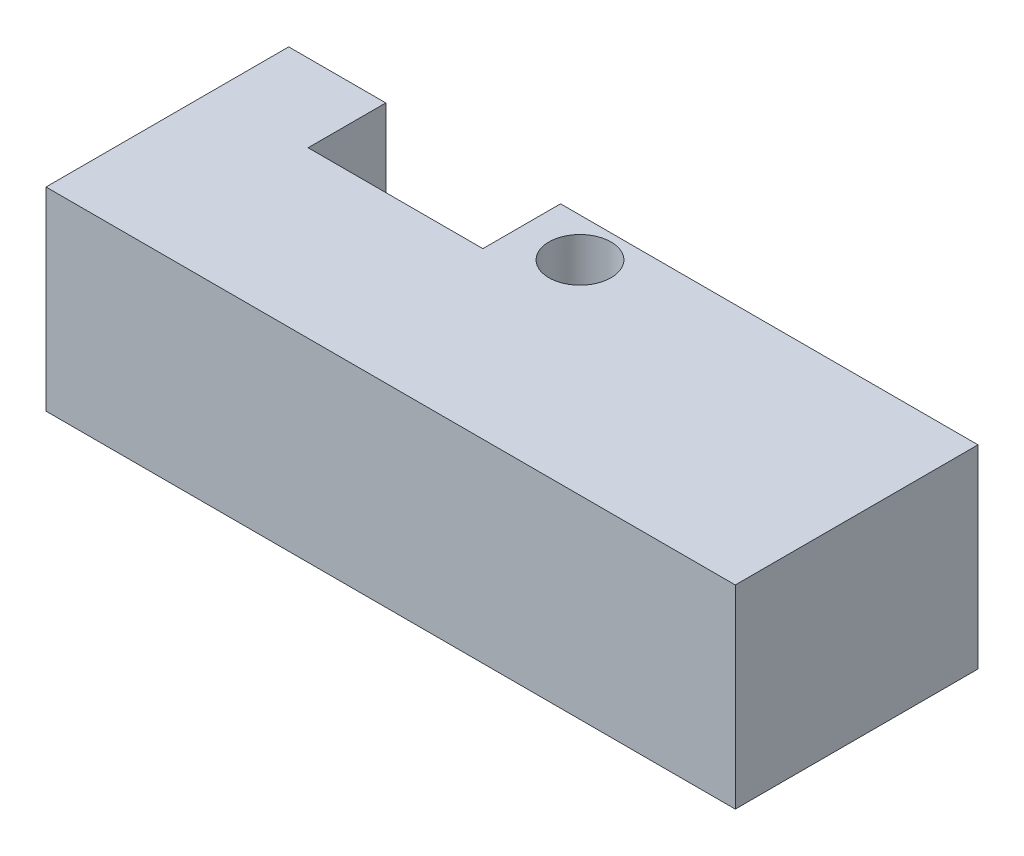
ISO-10303-21;
HEADER;
FILE_DESCRIPTION(('STEP AP214'),'2;1');
FILE_NAME('part.step','',(''),(''),'','','');
FILE_SCHEMA(('AUTOMOTIVE_DESIGN { 1 0 10303 214 1 1 1 1 }'));
ENDSEC;
DATA;
#1=APPLICATION_CONTEXT('core data for automotive mechanical design processes');
#2=APPLICATION_PROTOCOL_DEFINITION('international standard','automotive_design',2000,#1);
#3=PRODUCT_CONTEXT('',#1,'mechanical');
#4=PRODUCT('Part','Part','',(#3));
#5=PRODUCT_RELATED_PRODUCT_CATEGORY('part','',(#4));
#6=PRODUCT_DEFINITION_FORMATION('','',#4);
#7=PRODUCT_DEFINITION_CONTEXT('part definition',#1,'design');
#8=PRODUCT_DEFINITION('design','',#6,#7);
#9=PRODUCT_DEFINITION_SHAPE('','',#8);
#10=(LENGTH_UNIT() NAMED_UNIT(*) SI_UNIT(.MILLI.,.METRE.));
#11=(NAMED_UNIT(*) PLANE_ANGLE_UNIT() SI_UNIT($,.RADIAN.));
#12=(NAMED_UNIT(*) SI_UNIT($,.STERADIAN.) SOLID_ANGLE_UNIT());
#13=UNCERTAINTY_MEASURE_WITH_UNIT(LENGTH_MEASURE(1.E-05),#10,'distance_accuracy_value','');
#14=(GEOMETRIC_REPRESENTATION_CONTEXT(3) GLOBAL_UNCERTAINTY_ASSIGNED_CONTEXT((#13)) GLOBAL_UNIT_ASSIGNED_CONTEXT((#10,
#11,#12)) REPRESENTATION_CONTEXT('',''));
#15=CARTESIAN_POINT('',(0.,0.,0.));
#16=DIRECTION('',(0.,0.,1.));
#17=DIRECTION('',(1.,0.,0.));
#18=AXIS2_PLACEMENT_3D('',#15,#16,#17);
#19=CARTESIAN_POINT('',(-17.75,10.,-6.25));
#20=DIRECTION('',(0.,0.,1.));
#21=DIRECTION('',(1.,0.,0.));
#22=AXIS2_PLACEMENT_3D('',#19,#20,#21);
#23=PLANE('',#22);
#24=CARTESIAN_POINT('',(-14.75,3.,-6.25));
#25=DIRECTION('',(0.,0.,-1.));
#26=DIRECTION('',(1.,0.,0.));
#27=AXIS2_PLACEMENT_3D('',#24,#25,#26);
#28=CIRCLE('',#27,1.);
#29=CARTESIAN_POINT('',(-13.75,3.,-6.25));
#30=VERTEX_POINT('',#29);
#31=EDGE_CURVE('E148',#30,#30,#28,.T.);
#32=ORIENTED_EDGE('',*,*,#31,.F.);
#33=EDGE_LOOP('',(#32));
#34=FACE_BOUND('',#33,.T.);
#35=DIRECTION('',(-1.,0.,0.));
#36=VECTOR('',#35,1.);
#37=CARTESIAN_POINT('',(-17.75,10.,-6.25));
#38=LINE('',#37,#36);
#39=CARTESIAN_POINT('',(-12.75,10.,-6.25));
#40=VERTEX_POINT('',#39);
#41=CARTESIAN_POINT('',(-17.75,10.,-6.25));
#42=VERTEX_POINT('',#41);
#43=EDGE_CURVE('E188',#40,#42,#38,.T.);
#44=ORIENTED_EDGE('',*,*,#43,.F.);
#45=DIRECTION('',(0.,-1.,0.));
#46=VECTOR('',#45,1.);
#47=CARTESIAN_POINT('',(-12.75,7.5,-6.25));
#48=LINE('',#47,#46);
#49=CARTESIAN_POINT('',(-12.75,0.,-6.25));
#50=VERTEX_POINT('',#49);
#51=EDGE_CURVE('E122',#40,#50,#48,.T.);
#52=ORIENTED_EDGE('',*,*,#51,.T.);
#53=DIRECTION('',(-1.,0.,0.));
#54=VECTOR('',#53,1.);
#55=CARTESIAN_POINT('',(-17.75,0.,-6.25));
#56=LINE('',#55,#54);
#57=CARTESIAN_POINT('',(-17.75,0.,-6.25));
#58=VERTEX_POINT('',#57);
#59=EDGE_CURVE('E199',#50,#58,#56,.T.);
#60=ORIENTED_EDGE('',*,*,#59,.T.);
#61=DIRECTION('',(0.,-1.,0.));
#62=VECTOR('',#61,1.);
#63=CARTESIAN_POINT('',(-17.75,10.,-6.25));
#64=LINE('',#63,#62);
#65=EDGE_CURVE('E41',#42,#58,#64,.T.);
#66=ORIENTED_EDGE('',*,*,#65,.F.);
#67=EDGE_LOOP('',(#44,#52,#60,#66));
#68=FACE_BOUND('',#67,.T.);
#69=ADVANCED_FACE('F33',(#34,#68),#23,.F.);
#70=CARTESIAN_POINT('',(17.75,10.,6.25));
#71=DIRECTION('',(-1.,0.,0.));
#72=DIRECTION('',(0.,0.,1.));
#73=AXIS2_PLACEMENT_3D('',#70,#71,#72);
#74=PLANE('',#73);
#75=DIRECTION('',(0.,0.,-1.));
#76=VECTOR('',#75,1.);
#77=CARTESIAN_POINT('',(17.75,0.,6.25));
#78=LINE('',#77,#76);
#79=CARTESIAN_POINT('',(17.75,0.,6.25));
#80=VERTEX_POINT('',#79);
#81=CARTESIAN_POINT('',(17.75,0.,-6.25));
#82=VERTEX_POINT('',#81);
#83=EDGE_CURVE('E180',#80,#82,#78,.T.);
#84=ORIENTED_EDGE('',*,*,#83,.T.);
#85=DIRECTION('',(0.,-1.,0.));
#86=VECTOR('',#85,1.);
#87=CARTESIAN_POINT('',(17.75,10.,-6.25));
#88=LINE('',#87,#86);
#89=CARTESIAN_POINT('',(17.75,10.,-6.25));
#90=VERTEX_POINT('',#89);
#91=EDGE_CURVE('E11',#90,#82,#88,.T.);
#92=ORIENTED_EDGE('',*,*,#91,.F.);
#93=DIRECTION('',(0.,0.,-1.));
#94=VECTOR('',#93,1.);
#95=CARTESIAN_POINT('',(17.75,10.,6.25));
#96=LINE('',#95,#94);
#97=CARTESIAN_POINT('',(17.75,10.,6.25));
#98=VERTEX_POINT('',#97);
#99=EDGE_CURVE('E185',#98,#90,#96,.T.);
#100=ORIENTED_EDGE('',*,*,#99,.F.);
#101=DIRECTION('',(0.,-1.,0.));
#102=VECTOR('',#101,1.);
#103=CARTESIAN_POINT('',(17.75,10.,6.25));
#104=LINE('',#103,#102);
#105=EDGE_CURVE('E196',#98,#80,#104,.T.);
#106=ORIENTED_EDGE('',*,*,#105,.T.);
#107=EDGE_LOOP('',(#84,#92,#100,#106));
#108=FACE_BOUND('',#107,.T.);
#109=ADVANCED_FACE('F35',(#108),#74,.F.);
#110=CARTESIAN_POINT('',(14.75,3.,-6.25));
#111=DIRECTION('',(0.,0.,-1.));
#112=DIRECTION('',(-1.,0.,0.));
#113=AXIS2_PLACEMENT_3D('',#110,#111,#112);
#114=CIRCLE('',#113,1.);
#115=CARTESIAN_POINT('',(13.75,3.,-6.25));
#116=VERTEX_POINT('',#115);
#117=EDGE_CURVE('E153',#116,#116,#114,.T.);
#118=ORIENTED_EDGE('',*,*,#117,.F.);
#119=EDGE_LOOP('',(#118));
#120=FACE_BOUND('',#119,.T.);
#121=DIRECTION('',(1.,0.,0.));
#122=VECTOR('',#121,1.);
#123=CARTESIAN_POINT('',(-12.75,7.5,-6.25));
#124=LINE('',#123,#122);
#125=CARTESIAN_POINT('',(-3.74999999999999,7.5,-6.25));
#126=VERTEX_POINT('',#125);
#127=CARTESIAN_POINT('',(12.75,7.5,-6.25000000000001));
#128=VERTEX_POINT('',#127);
#129=EDGE_CURVE('E167',#126,#128,#124,.T.);
#130=ORIENTED_EDGE('',*,*,#129,.F.);
#131=DIRECTION('',(0.,-1.,0.));
#132=VECTOR('',#131,1.);
#133=CARTESIAN_POINT('',(-3.74999999999999,7.5,-6.25));
#134=LINE('',#133,#132);
#135=CARTESIAN_POINT('',(-3.74999999999999,10.,-6.25));
#136=VERTEX_POINT('',#135);
#137=EDGE_CURVE('E134',#136,#126,#134,.T.);
#138=ORIENTED_EDGE('',*,*,#137,.F.);
#139=EDGE_CURVE('E190',#90,#136,#38,.T.);
#140=ORIENTED_EDGE('',*,*,#139,.F.);
#141=ORIENTED_EDGE('',*,*,#91,.T.);
#142=CARTESIAN_POINT('',(12.75,0.,-6.25000000000001));
#143=VERTEX_POINT('',#142);
#144=EDGE_CURVE('E200',#82,#143,#56,.T.);
#145=ORIENTED_EDGE('',*,*,#144,.T.);
#146=DIRECTION('',(0.,-1.,0.));
#147=VECTOR('',#146,1.);
#148=CARTESIAN_POINT('',(12.75,7.5,-6.25000000000001));
#149=LINE('',#148,#147);
#150=EDGE_CURVE('E181',#128,#143,#149,.T.);
#151=ORIENTED_EDGE('',*,*,#150,.F.);
#152=EDGE_LOOP('',(#130,#138,#140,#141,#145,#151));
#153=FACE_BOUND('',#152,.T.);
#154=ADVANCED_FACE('F234',(#120,#153),#23,.F.);
#155=CARTESIAN_POINT('',(-17.75,10.,6.25));
#156=DIRECTION('',(1.,0.,0.));
#157=DIRECTION('',(0.,0.,-1.));
#158=AXIS2_PLACEMENT_3D('',#155,#156,#157);
#159=PLANE('',#158);
#160=DIRECTION('',(0.,0.,1.));
#161=VECTOR('',#160,1.);
#162=CARTESIAN_POINT('',(-17.75,0.,6.25));
#163=LINE('',#162,#161);
#164=CARTESIAN_POINT('',(-17.75,0.,6.25));
#165=VERTEX_POINT('',#164);
#166=EDGE_CURVE('E203',#58,#165,#163,.T.);
#167=ORIENTED_EDGE('',*,*,#166,.T.);
#168=DIRECTION('',(0.,-1.,0.));
#169=VECTOR('',#168,1.);
#170=CARTESIAN_POINT('',(-17.75,10.,6.25));
#171=LINE('',#170,#169);
#172=CARTESIAN_POINT('',(-17.75,10.,6.25));
#173=VERTEX_POINT('',#172);
#174=EDGE_CURVE('E208',#173,#165,#171,.T.);
#175=ORIENTED_EDGE('',*,*,#174,.F.);
#176=DIRECTION('',(0.,0.,1.));
#177=VECTOR('',#176,1.);
#178=CARTESIAN_POINT('',(-17.75,10.,6.25));
#179=LINE('',#178,#177);
#180=EDGE_CURVE('E192',#42,#173,#179,.T.);
#181=ORIENTED_EDGE('',*,*,#180,.F.);
#182=ORIENTED_EDGE('',*,*,#65,.T.);
#183=EDGE_LOOP('',(#167,#175,#181,#182));
#184=FACE_BOUND('',#183,.T.);
#185=ADVANCED_FACE('F215',(#184),#159,.F.);
#186=CARTESIAN_POINT('',(-17.75,10.,6.25));
#187=DIRECTION('',(0.,0.,-1.));
#188=DIRECTION('',(-1.,0.,0.));
#189=AXIS2_PLACEMENT_3D('',#186,#187,#188);
#190=PLANE('',#189);
#191=DIRECTION('',(1.,0.,0.));
#192=VECTOR('',#191,1.);
#193=CARTESIAN_POINT('',(-17.75,0.,6.25));
#194=LINE('',#193,#192);
#195=EDGE_CURVE('E189',#165,#80,#194,.T.);
#196=ORIENTED_EDGE('',*,*,#195,.T.);
#197=ORIENTED_EDGE('',*,*,#105,.F.);
#198=DIRECTION('',(1.,0.,0.));
#199=VECTOR('',#198,1.);
#200=CARTESIAN_POINT('',(-17.75,10.,6.25));
#201=LINE('',#200,#199);
#202=EDGE_CURVE('E194',#173,#98,#201,.T.);
#203=ORIENTED_EDGE('',*,*,#202,.F.);
#204=ORIENTED_EDGE('',*,*,#174,.T.);
#205=EDGE_LOOP('',(#196,#197,#203,#204));
#206=FACE_BOUND('',#205,.T.);
#207=ADVANCED_FACE('F227',(#206),#190,.F.);
#208=CARTESIAN_POINT('',(0.,10.,0.));
#209=DIRECTION('',(0.,-1.,0.));
#210=DIRECTION('',(0.,0.,-1.));
#211=AXIS2_PLACEMENT_3D('',#208,#209,#210);
#212=PLANE('',#211);
#213=CARTESIAN_POINT('',(-0.749999999999989,10.,-4.25));
#214=DIRECTION('',(0.,-1.,0.));
#215=DIRECTION('',(0.,0.,-1.));
#216=AXIS2_PLACEMENT_3D('',#213,#214,#215);
#217=CIRCLE('',#216,1.6);
#218=CARTESIAN_POINT('',(-0.749999999999989,10.,-5.85));
#219=VERTEX_POINT('',#218);
#220=EDGE_CURVE('E144',#219,#219,#217,.F.);
#221=ORIENTED_EDGE('',*,*,#220,.F.);
#222=EDGE_LOOP('',(#221));
#223=FACE_BOUND('',#222,.T.);
#224=DIRECTION('',(1.,0.,0.));
#225=VECTOR('',#224,1.);
#226=CARTESIAN_POINT('',(-12.75,10.,-2.25));
#227=LINE('',#226,#225);
#228=CARTESIAN_POINT('',(-12.75,10.,-2.25));
#229=VERTEX_POINT('',#228);
#230=CARTESIAN_POINT('',(-3.74999999999999,10.,-2.25));
#231=VERTEX_POINT('',#230);
#232=EDGE_CURVE('E130',#229,#231,#227,.T.);
#233=ORIENTED_EDGE('',*,*,#232,.F.);
#234=DIRECTION('',(0.,0.,-1.));
#235=VECTOR('',#234,1.);
#236=CARTESIAN_POINT('',(-12.75,10.,-2.25));
#237=LINE('',#236,#235);
#238=EDGE_CURVE('E116',#229,#40,#237,.T.);
#239=ORIENTED_EDGE('',*,*,#238,.T.);
#240=ORIENTED_EDGE('',*,*,#43,.T.);
#241=ORIENTED_EDGE('',*,*,#180,.T.);
#242=ORIENTED_EDGE('',*,*,#202,.T.);
#243=ORIENTED_EDGE('',*,*,#99,.T.);
#244=ORIENTED_EDGE('',*,*,#139,.T.);
#245=DIRECTION('',(0.,0.,-1.));
#246=VECTOR('',#245,1.);
#247=CARTESIAN_POINT('',(-3.74999999999999,10.,-2.25));
#248=LINE('',#247,#246);
#249=EDGE_CURVE('E126',#231,#136,#248,.T.);
#250=ORIENTED_EDGE('',*,*,#249,.F.);
#251=EDGE_LOOP('',(#233,#239,#240,#241,#242,#243,#244,#250));
#252=FACE_BOUND('',#251,.T.);
#253=ADVANCED_FACE('F136',(#223,#252),#212,.F.);
#254=CARTESIAN_POINT('',(0.,0.,0.));
#255=DIRECTION('',(0.,-1.,0.));
#256=DIRECTION('',(0.,0.,-1.));
#257=AXIS2_PLACEMENT_3D('',#254,#255,#256);
#258=PLANE('',#257);
#259=DIRECTION('',(0.,0.,1.));
#260=VECTOR('',#259,1.);
#261=CARTESIAN_POINT('',(12.75,0.,1.25000000000001));
#262=LINE('',#261,#260);
#263=CARTESIAN_POINT('',(12.75,0.,1.25000000000001));
#264=VERTEX_POINT('',#263);
#265=EDGE_CURVE('E165',#143,#264,#262,.T.);
#266=ORIENTED_EDGE('',*,*,#265,.F.);
#267=ORIENTED_EDGE('',*,*,#144,.F.);
#268=ORIENTED_EDGE('',*,*,#83,.F.);
#269=ORIENTED_EDGE('',*,*,#195,.F.);
#270=ORIENTED_EDGE('',*,*,#166,.F.);
#271=ORIENTED_EDGE('',*,*,#59,.F.);
#272=DIRECTION('',(0.,0.,-1.));
#273=VECTOR('',#272,1.);
#274=CARTESIAN_POINT('',(-12.75,0.,1.25));
#275=LINE('',#274,#273);
#276=CARTESIAN_POINT('',(-12.75,0.,1.25));
#277=VERTEX_POINT('',#276);
#278=EDGE_CURVE('E174',#277,#50,#275,.T.);
#279=ORIENTED_EDGE('',*,*,#278,.F.);
#280=DIRECTION('',(-1.,0.,0.));
#281=VECTOR('',#280,1.);
#282=CARTESIAN_POINT('',(-12.75,0.,1.25));
#283=LINE('',#282,#281);
#284=EDGE_CURVE('E56',#264,#277,#283,.T.);
#285=ORIENTED_EDGE('',*,*,#284,.F.);
#286=EDGE_LOOP('',(#266,#267,#268,#269,#270,#271,#279,#285));
#287=FACE_BOUND('',#286,.T.);
#288=ADVANCED_FACE('F222',(#287),#258,.T.);
#289=CARTESIAN_POINT('',(-12.75,7.5,1.25));
#290=DIRECTION('',(0.,0.,1.));
#291=DIRECTION('',(1.,0.,0.));
#292=AXIS2_PLACEMENT_3D('',#289,#290,#291);
#293=PLANE('',#292);
#294=ORIENTED_EDGE('',*,*,#284,.T.);
#295=DIRECTION('',(0.,-1.,0.));
#296=VECTOR('',#295,1.);
#297=CARTESIAN_POINT('',(-12.75,7.5,1.25));
#298=LINE('',#297,#296);
#299=CARTESIAN_POINT('',(-12.75,7.5,1.25));
#300=VERTEX_POINT('',#299);
#301=EDGE_CURVE('E172',#300,#277,#298,.T.);
#302=ORIENTED_EDGE('',*,*,#301,.F.);
#303=DIRECTION('',(-1.,0.,0.));
#304=VECTOR('',#303,1.);
#305=CARTESIAN_POINT('',(-12.75,7.5,1.25));
#306=LINE('',#305,#304);
#307=CARTESIAN_POINT('',(12.75,7.5,1.25000000000001));
#308=VERTEX_POINT('',#307);
#309=EDGE_CURVE('E161',#308,#300,#306,.T.);
#310=ORIENTED_EDGE('',*,*,#309,.F.);
#311=DIRECTION('',(0.,-1.,0.));
#312=VECTOR('',#311,1.);
#313=CARTESIAN_POINT('',(12.75,7.5,1.25000000000001));
#314=LINE('',#313,#312);
#315=EDGE_CURVE('E178',#308,#264,#314,.T.);
#316=ORIENTED_EDGE('',*,*,#315,.T.);
#317=EDGE_LOOP('',(#294,#302,#310,#316));
#318=FACE_BOUND('',#317,.T.);
#319=ADVANCED_FACE('F258',(#318),#293,.F.);
#320=CARTESIAN_POINT('',(12.75,7.5,1.25000000000001));
#321=DIRECTION('',(1.,0.,0.));
#322=DIRECTION('',(0.,0.,-1.));
#323=AXIS2_PLACEMENT_3D('',#320,#321,#322);
#324=PLANE('',#323);
#325=ORIENTED_EDGE('',*,*,#265,.T.);
#326=ORIENTED_EDGE('',*,*,#315,.F.);
#327=DIRECTION('',(0.,0.,1.));
#328=VECTOR('',#327,1.);
#329=CARTESIAN_POINT('',(12.75,7.5,1.25000000000001));
#330=LINE('',#329,#328);
#331=EDGE_CURVE('E169',#128,#308,#330,.T.);
#332=ORIENTED_EDGE('',*,*,#331,.F.);
#333=ORIENTED_EDGE('',*,*,#150,.T.);
#334=EDGE_LOOP('',(#325,#326,#332,#333));
#335=FACE_BOUND('',#334,.T.);
#336=ADVANCED_FACE('F256',(#335),#324,.F.);
#337=CARTESIAN_POINT('',(-12.75,7.5,1.25));
#338=DIRECTION('',(-1.,0.,0.));
#339=DIRECTION('',(0.,0.,1.));
#340=AXIS2_PLACEMENT_3D('',#337,#338,#339);
#341=PLANE('',#340);
#342=ORIENTED_EDGE('',*,*,#278,.T.);
#343=ORIENTED_EDGE('',*,*,#51,.F.);
#344=ORIENTED_EDGE('',*,*,#238,.F.);
#345=DIRECTION('',(0.,1.,0.));
#346=VECTOR('',#345,1.);
#347=CARTESIAN_POINT('',(-12.75,7.5,-2.25));
#348=LINE('',#347,#346);
#349=CARTESIAN_POINT('',(-12.75,7.5,-2.25));
#350=VERTEX_POINT('',#349);
#351=EDGE_CURVE('E120',#350,#229,#348,.T.);
#352=ORIENTED_EDGE('',*,*,#351,.F.);
#353=DIRECTION('',(0.,0.,-1.));
#354=VECTOR('',#353,1.);
#355=CARTESIAN_POINT('',(-12.75,7.5,1.25));
#356=LINE('',#355,#354);
#357=EDGE_CURVE('E164',#300,#350,#356,.T.);
#358=ORIENTED_EDGE('',*,*,#357,.F.);
#359=ORIENTED_EDGE('',*,*,#301,.T.);
#360=EDGE_LOOP('',(#342,#343,#344,#352,#358,#359));
#361=FACE_BOUND('',#360,.T.);
#362=ADVANCED_FACE('F118',(#361),#341,.F.);
#363=CARTESIAN_POINT('',(0.,7.5,0.));
#364=DIRECTION('',(0.,1.,0.));
#365=DIRECTION('',(0.,0.,1.));
#366=AXIS2_PLACEMENT_3D('',#363,#364,#365);
#367=PLANE('',#366);
#368=CARTESIAN_POINT('',(-0.749999999999989,7.5,-4.25));
#369=DIRECTION('',(0.,1.,0.));
#370=DIRECTION('',(0.,0.,1.));
#371=AXIS2_PLACEMENT_3D('',#368,#369,#370);
#372=CIRCLE('',#371,1.6);
#373=CARTESIAN_POINT('',(-0.749999999999989,7.5,-2.65));
#374=VERTEX_POINT('',#373);
#375=EDGE_CURVE('E392',#374,#374,#372,.F.);
#376=ORIENTED_EDGE('',*,*,#375,.F.);
#377=EDGE_LOOP('',(#376));
#378=FACE_BOUND('',#377,.T.);
#379=DIRECTION('',(-1.,0.,0.));
#380=VECTOR('',#379,1.);
#381=CARTESIAN_POINT('',(-12.75,7.5,-2.25));
#382=LINE('',#381,#380);
#383=CARTESIAN_POINT('',(-3.74999999999999,7.5,-2.25));
#384=VERTEX_POINT('',#383);
#385=EDGE_CURVE('E127',#384,#350,#382,.T.);
#386=ORIENTED_EDGE('',*,*,#385,.F.);
#387=DIRECTION('',(0.,0.,-1.));
#388=VECTOR('',#387,1.);
#389=CARTESIAN_POINT('',(-3.74999999999999,7.5,-2.25));
#390=LINE('',#389,#388);
#391=EDGE_CURVE('E145',#384,#126,#390,.T.);
#392=ORIENTED_EDGE('',*,*,#391,.T.);
#393=ORIENTED_EDGE('',*,*,#129,.T.);
#394=ORIENTED_EDGE('',*,*,#331,.T.);
#395=ORIENTED_EDGE('',*,*,#309,.T.);
#396=ORIENTED_EDGE('',*,*,#357,.T.);
#397=EDGE_LOOP('',(#386,#392,#393,#394,#395,#396));
#398=FACE_BOUND('',#397,.T.);
#399=ADVANCED_FACE('F254',(#378,#398),#367,.F.);
#400=CARTESIAN_POINT('',(-14.75,3.,-2.25));
#401=DIRECTION('',(0.,0.,-1.));
#402=DIRECTION('',(-1.,0.,0.));
#403=AXIS2_PLACEMENT_3D('',#400,#401,#402);
#404=CYLINDRICAL_SURFACE('',#403,1.);
#405=CARTESIAN_POINT('',(-14.75,3.,-2.25));
#406=DIRECTION('',(0.,0.,-1.));
#407=DIRECTION('',(1.,0.,0.));
#408=AXIS2_PLACEMENT_3D('',#405,#406,#407);
#409=CIRCLE('',#408,1.);
#410=CARTESIAN_POINT('',(-13.75,3.,-2.25));
#411=VERTEX_POINT('',#410);
#412=EDGE_CURVE('E156',#411,#411,#409,.T.);
#413=ORIENTED_EDGE('',*,*,#412,.F.);
#414=EDGE_LOOP('',(#413));
#415=FACE_BOUND('',#414,.T.);
#416=ORIENTED_EDGE('',*,*,#31,.T.);
#417=EDGE_LOOP('',(#416));
#418=FACE_BOUND('',#417,.T.);
#419=ADVANCED_FACE('F306',(#415,#418),#404,.F.);
#420=CARTESIAN_POINT('',(-14.75,3.,-2.25));
#421=DIRECTION('',(0.,0.,1.));
#422=DIRECTION('',(1.,0.,0.));
#423=AXIS2_PLACEMENT_3D('',#420,#421,#422);
#424=PLANE('',#423);
#425=ORIENTED_EDGE('',*,*,#412,.T.);
#426=EDGE_LOOP('',(#425));
#427=FACE_BOUND('',#426,.T.);
#428=ADVANCED_FACE('F311',(#427),#424,.F.);
#429=CARTESIAN_POINT('',(14.75,3.,-2.25));
#430=DIRECTION('',(0.,0.,-1.));
#431=DIRECTION('',(-1.,0.,0.));
#432=AXIS2_PLACEMENT_3D('',#429,#430,#431);
#433=CYLINDRICAL_SURFACE('',#432,1.);
#434=CARTESIAN_POINT('',(14.75,3.,-2.25));
#435=DIRECTION('',(0.,0.,-1.));
#436=DIRECTION('',(-1.,0.,0.));
#437=AXIS2_PLACEMENT_3D('',#434,#435,#436);
#438=CIRCLE('',#437,1.);
#439=CARTESIAN_POINT('',(13.75,3.,-2.25));
#440=VERTEX_POINT('',#439);
#441=EDGE_CURVE('E150',#440,#440,#438,.T.);
#442=ORIENTED_EDGE('',*,*,#441,.F.);
#443=EDGE_LOOP('',(#442));
#444=FACE_BOUND('',#443,.T.);
#445=ORIENTED_EDGE('',*,*,#117,.T.);
#446=EDGE_LOOP('',(#445));
#447=FACE_BOUND('',#446,.T.);
#448=ADVANCED_FACE('F322',(#444,#447),#433,.F.);
#449=CARTESIAN_POINT('',(14.75,3.,-2.25));
#450=DIRECTION('',(0.,0.,-1.));
#451=DIRECTION('',(-1.,0.,0.));
#452=AXIS2_PLACEMENT_3D('',#449,#450,#451);
#453=PLANE('',#452);
#454=ORIENTED_EDGE('',*,*,#441,.T.);
#455=EDGE_LOOP('',(#454));
#456=FACE_BOUND('',#455,.T.);
#457=ADVANCED_FACE('F331',(#456),#453,.T.);
#458=CARTESIAN_POINT('',(-3.74999999999999,7.5,-2.25));
#459=DIRECTION('',(1.,0.,0.));
#460=DIRECTION('',(0.,1.,0.));
#461=AXIS2_PLACEMENT_3D('',#458,#459,#460);
#462=PLANE('',#461);
#463=ORIENTED_EDGE('',*,*,#137,.T.);
#464=ORIENTED_EDGE('',*,*,#391,.F.);
#465=DIRECTION('',(0.,-1.,0.));
#466=VECTOR('',#465,1.);
#467=CARTESIAN_POINT('',(-3.74999999999999,7.5,-2.25));
#468=LINE('',#467,#466);
#469=EDGE_CURVE('E48',#231,#384,#468,.T.);
#470=ORIENTED_EDGE('',*,*,#469,.F.);
#471=ORIENTED_EDGE('',*,*,#249,.T.);
#472=EDGE_LOOP('',(#463,#464,#470,#471));
#473=FACE_BOUND('',#472,.T.);
#474=ADVANCED_FACE('F340',(#473),#462,.F.);
#475=CARTESIAN_POINT('',(0.,0.,-2.25));
#476=DIRECTION('',(0.,0.,-1.));
#477=DIRECTION('',(-1.,0.,0.));
#478=AXIS2_PLACEMENT_3D('',#475,#476,#477);
#479=PLANE('',#478);
#480=ORIENTED_EDGE('',*,*,#351,.T.);
#481=ORIENTED_EDGE('',*,*,#232,.T.);
#482=ORIENTED_EDGE('',*,*,#469,.T.);
#483=ORIENTED_EDGE('',*,*,#385,.T.);
#484=EDGE_LOOP('',(#480,#481,#482,#483));
#485=FACE_BOUND('',#484,.T.);
#486=ADVANCED_FACE('F129',(#485),#479,.T.);
#487=CARTESIAN_POINT('',(-0.749999999999989,10.000012,-4.25));
#488=DIRECTION('',(0.,-1.,0.));
#489=DIRECTION('',(0.,0.,-1.));
#490=AXIS2_PLACEMENT_3D('',#487,#488,#489);
#491=CYLINDRICAL_SURFACE('',#490,1.6);
#492=ORIENTED_EDGE('',*,*,#375,.T.);
#493=EDGE_LOOP('',(#492));
#494=FACE_BOUND('',#493,.T.);
#495=ORIENTED_EDGE('',*,*,#220,.T.);
#496=EDGE_LOOP('',(#495));
#497=FACE_BOUND('',#496,.T.);
#498=ADVANCED_FACE('F364',(#494,#497),#491,.F.);
#499=CLOSED_SHELL('',(#69,#109,#154,#185,#207,#253,#288,#319,#336,#362,#399,#419,#428,#448,#457,
#474,#486,#498));
#500=MANIFOLD_SOLID_BREP('B2',#499);
#501=ADVANCED_BREP_SHAPE_REPRESENTATION('',(#18,#500),#14);
#502=SHAPE_DEFINITION_REPRESENTATION(#9,#501);
ENDSEC;
END-ISO-10303-21;
